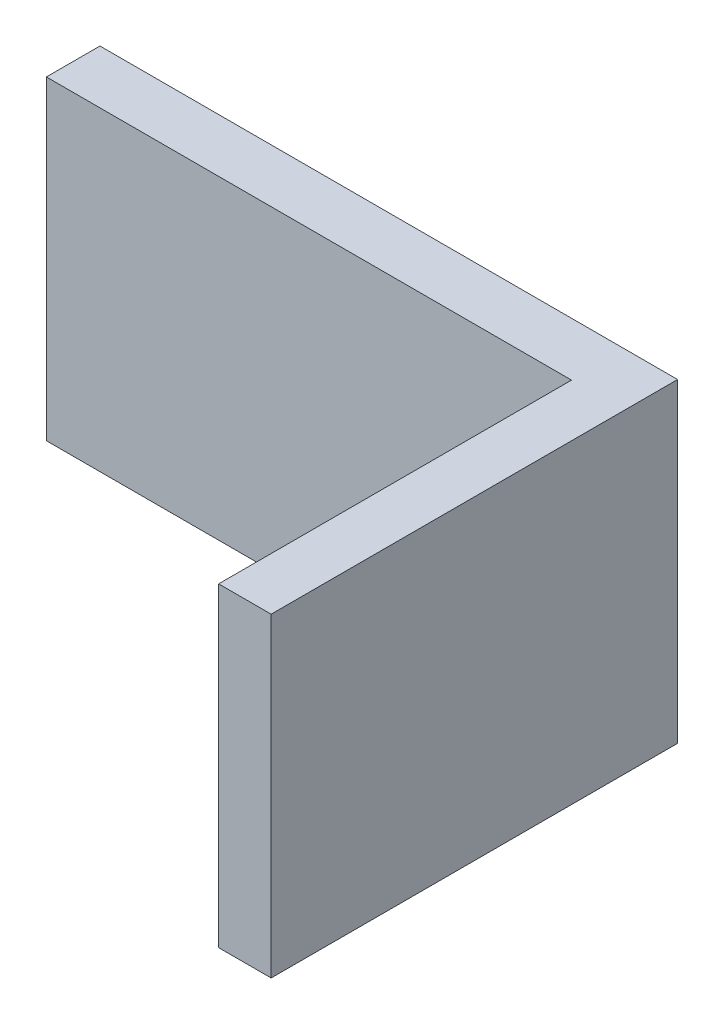
ISO-10303-21;
HEADER;
FILE_DESCRIPTION(('STEP AP214'),'2;1');
FILE_NAME('part.step','',(''),(''),'','','');
FILE_SCHEMA(('AUTOMOTIVE_DESIGN { 1 0 10303 214 1 1 1 1 }'));
ENDSEC;
DATA;
#1=APPLICATION_CONTEXT('core data for automotive mechanical design processes');
#2=APPLICATION_PROTOCOL_DEFINITION('international standard','automotive_design',2000,#1);
#3=PRODUCT_CONTEXT('',#1,'mechanical');
#4=PRODUCT('Part','Part','',(#3));
#5=PRODUCT_RELATED_PRODUCT_CATEGORY('part','',(#4));
#6=PRODUCT_DEFINITION_FORMATION('','',#4);
#7=PRODUCT_DEFINITION_CONTEXT('part definition',#1,'design');
#8=PRODUCT_DEFINITION('design','',#6,#7);
#9=PRODUCT_DEFINITION_SHAPE('','',#8);
#10=(LENGTH_UNIT() NAMED_UNIT(*) SI_UNIT(.MILLI.,.METRE.));
#11=(NAMED_UNIT(*) PLANE_ANGLE_UNIT() SI_UNIT($,.RADIAN.));
#12=(NAMED_UNIT(*) SI_UNIT($,.STERADIAN.) SOLID_ANGLE_UNIT());
#13=UNCERTAINTY_MEASURE_WITH_UNIT(LENGTH_MEASURE(1.E-05),#10,'distance_accuracy_value','');
#14=(GEOMETRIC_REPRESENTATION_CONTEXT(3) GLOBAL_UNCERTAINTY_ASSIGNED_CONTEXT((#13)) GLOBAL_UNIT_ASSIGNED_CONTEXT((#10,
#11,#12)) REPRESENTATION_CONTEXT('',''));
#15=CARTESIAN_POINT('',(0.,0.,0.));
#16=DIRECTION('',(0.,0.,1.));
#17=DIRECTION('',(1.,0.,0.));
#18=AXIS2_PLACEMENT_3D('',#15,#16,#17);
#19=CARTESIAN_POINT('',(4.55,-2.1,0.));
#20=DIRECTION('',(0.,1.,0.));
#21=DIRECTION('',(0.,0.,1.));
#22=AXIS2_PLACEMENT_3D('',#19,#20,#21);
#23=PLANE('',#22);
#24=DIRECTION('',(1.,0.,0.));
#25=VECTOR('',#24,1.);
#26=CARTESIAN_POINT('',(4.,-2.1,0.));
#27=LINE('',#26,#25);
#28=CARTESIAN_POINT('',(4.,-2.1,0.));
#29=VERTEX_POINT('',#28);
#30=CARTESIAN_POINT('',(4.55,-2.1,0.));
#31=VERTEX_POINT('',#30);
#32=EDGE_CURVE('E11',#29,#31,#27,.T.);
#33=ORIENTED_EDGE('',*,*,#32,.F.);
#34=DIRECTION('',(0.,0.,-1.));
#35=VECTOR('',#34,1.);
#36=CARTESIAN_POINT('',(4.,-2.1,0.051));
#37=LINE('',#36,#35);
#38=CARTESIAN_POINT('',(4.,-2.1,0.051));
#39=VERTEX_POINT('',#38);
#40=EDGE_CURVE('E24',#39,#29,#37,.T.);
#41=ORIENTED_EDGE('',*,*,#40,.F.);
#42=DIRECTION('',(-1.,0.,0.));
#43=VECTOR('',#42,1.);
#44=CARTESIAN_POINT('',(4.5,-2.1,0.051));
#45=LINE('',#44,#43);
#46=CARTESIAN_POINT('',(4.5,-2.1,0.051));
#47=VERTEX_POINT('',#46);
#48=EDGE_CURVE('E87',#47,#39,#45,.T.);
#49=ORIENTED_EDGE('',*,*,#48,.F.);
#50=DIRECTION('',(0.,0.,-1.));
#51=VECTOR('',#50,1.);
#52=CARTESIAN_POINT('',(4.5,-2.1,0.387));
#53=LINE('',#52,#51);
#54=CARTESIAN_POINT('',(4.5,-2.1,0.387));
#55=VERTEX_POINT('',#54);
#56=EDGE_CURVE('E114',#55,#47,#53,.T.);
#57=ORIENTED_EDGE('',*,*,#56,.F.);
#58=DIRECTION('',(-1.,0.,0.));
#59=VECTOR('',#58,1.);
#60=CARTESIAN_POINT('',(4.55,-2.1,0.387));
#61=LINE('',#60,#59);
#62=CARTESIAN_POINT('',(4.55,-2.1,0.387));
#63=VERTEX_POINT('',#62);
#64=EDGE_CURVE('E111',#63,#55,#61,.T.);
#65=ORIENTED_EDGE('',*,*,#64,.F.);
#66=DIRECTION('',(0.,0.,1.));
#67=VECTOR('',#66,1.);
#68=CARTESIAN_POINT('',(4.55,-2.1,0.));
#69=LINE('',#68,#67);
#70=EDGE_CURVE('E108',#31,#63,#69,.T.);
#71=ORIENTED_EDGE('',*,*,#70,.F.);
#72=EDGE_LOOP('',(#33,#41,#49,#57,#65,#71));
#73=FACE_BOUND('',#72,.T.);
#74=ADVANCED_FACE('F17',(#73),#23,.T.);
#75=CARTESIAN_POINT('',(4.,-2.4,0.));
#76=DIRECTION('',(0.,-1.,0.));
#77=DIRECTION('',(0.,0.,1.));
#78=AXIS2_PLACEMENT_3D('',#75,#76,#77);
#79=PLANE('',#78);
#80=DIRECTION('',(-1.,0.,0.));
#81=VECTOR('',#80,1.);
#82=CARTESIAN_POINT('',(4.55,-2.4,0.));
#83=LINE('',#82,#81);
#84=CARTESIAN_POINT('',(4.55,-2.4,0.));
#85=VERTEX_POINT('',#84);
#86=CARTESIAN_POINT('',(4.,-2.4,0.));
#87=VERTEX_POINT('',#86);
#88=EDGE_CURVE('E106',#85,#87,#83,.T.);
#89=ORIENTED_EDGE('',*,*,#88,.F.);
#90=DIRECTION('',(0.,0.,-1.));
#91=VECTOR('',#90,1.);
#92=CARTESIAN_POINT('',(4.55,-2.4,0.387));
#93=LINE('',#92,#91);
#94=CARTESIAN_POINT('',(4.55,-2.4,0.387));
#95=VERTEX_POINT('',#94);
#96=EDGE_CURVE('E103',#95,#85,#93,.T.);
#97=ORIENTED_EDGE('',*,*,#96,.F.);
#98=DIRECTION('',(1.,0.,0.));
#99=VECTOR('',#98,1.);
#100=CARTESIAN_POINT('',(4.5,-2.4,0.387));
#101=LINE('',#100,#99);
#102=CARTESIAN_POINT('',(4.5,-2.4,0.387));
#103=VERTEX_POINT('',#102);
#104=EDGE_CURVE('E100',#103,#95,#101,.T.);
#105=ORIENTED_EDGE('',*,*,#104,.F.);
#106=DIRECTION('',(0.,0.,1.));
#107=VECTOR('',#106,1.);
#108=CARTESIAN_POINT('',(4.5,-2.4,0.051));
#109=LINE('',#108,#107);
#110=CARTESIAN_POINT('',(4.5,-2.4,0.051));
#111=VERTEX_POINT('',#110);
#112=EDGE_CURVE('E72',#111,#103,#109,.T.);
#113=ORIENTED_EDGE('',*,*,#112,.F.);
#114=DIRECTION('',(1.,0.,0.));
#115=VECTOR('',#114,1.);
#116=CARTESIAN_POINT('',(4.,-2.4,0.051));
#117=LINE('',#116,#115);
#118=CARTESIAN_POINT('',(4.,-2.4,0.051));
#119=VERTEX_POINT('',#118);
#120=EDGE_CURVE('E66',#119,#111,#117,.T.);
#121=ORIENTED_EDGE('',*,*,#120,.F.);
#122=DIRECTION('',(0.,0.,1.));
#123=VECTOR('',#122,1.);
#124=CARTESIAN_POINT('',(4.,-2.4,0.));
#125=LINE('',#124,#123);
#126=EDGE_CURVE('E69',#87,#119,#125,.T.);
#127=ORIENTED_EDGE('',*,*,#126,.F.);
#128=EDGE_LOOP('',(#89,#97,#105,#113,#121,#127));
#129=FACE_BOUND('',#128,.T.);
#130=ADVANCED_FACE('F68',(#129),#79,.T.);
#131=CARTESIAN_POINT('',(4.55,-2.1,0.387));
#132=DIRECTION('',(0.,0.,1.));
#133=DIRECTION('',(0.,1.,0.));
#134=AXIS2_PLACEMENT_3D('',#131,#132,#133);
#135=PLANE('',#134);
#136=ORIENTED_EDGE('',*,*,#64,.T.);
#137=DIRECTION('',(0.,1.,0.));
#138=VECTOR('',#137,1.);
#139=CARTESIAN_POINT('',(4.5,-2.4,0.387));
#140=LINE('',#139,#138);
#141=EDGE_CURVE('E83',#103,#55,#140,.T.);
#142=ORIENTED_EDGE('',*,*,#141,.F.);
#143=ORIENTED_EDGE('',*,*,#104,.T.);
#144=DIRECTION('',(0.,-1.,0.));
#145=VECTOR('',#144,1.);
#146=CARTESIAN_POINT('',(4.55,-2.1,0.387));
#147=LINE('',#146,#145);
#148=EDGE_CURVE('E88',#63,#95,#147,.T.);
#149=ORIENTED_EDGE('',*,*,#148,.F.);
#150=EDGE_LOOP('',(#136,#142,#143,#149));
#151=FACE_BOUND('',#150,.T.);
#152=ADVANCED_FACE('F125',(#151),#135,.T.);
#153=CARTESIAN_POINT('',(4.5,-2.1,0.051));
#154=DIRECTION('',(0.,0.,1.));
#155=DIRECTION('',(0.,1.,0.));
#156=AXIS2_PLACEMENT_3D('',#153,#154,#155);
#157=PLANE('',#156);
#158=ORIENTED_EDGE('',*,*,#48,.T.);
#159=DIRECTION('',(0.,1.,0.));
#160=VECTOR('',#159,1.);
#161=CARTESIAN_POINT('',(4.,-2.4,0.051));
#162=LINE('',#161,#160);
#163=EDGE_CURVE('E81',#119,#39,#162,.T.);
#164=ORIENTED_EDGE('',*,*,#163,.F.);
#165=ORIENTED_EDGE('',*,*,#120,.T.);
#166=DIRECTION('',(0.,-1.,0.));
#167=VECTOR('',#166,1.);
#168=CARTESIAN_POINT('',(4.5,-2.1,0.051));
#169=LINE('',#168,#167);
#170=EDGE_CURVE('E89',#47,#111,#169,.T.);
#171=ORIENTED_EDGE('',*,*,#170,.F.);
#172=EDGE_LOOP('',(#158,#164,#165,#171));
#173=FACE_BOUND('',#172,.T.);
#174=ADVANCED_FACE('F86',(#173),#157,.T.);
#175=CARTESIAN_POINT('',(4.55,-2.4,0.));
#176=DIRECTION('',(1.,0.,0.));
#177=DIRECTION('',(0.,0.,1.));
#178=AXIS2_PLACEMENT_3D('',#175,#176,#177);
#179=PLANE('',#178);
#180=DIRECTION('',(0.,-1.,0.));
#181=VECTOR('',#180,1.);
#182=CARTESIAN_POINT('',(4.55,-2.1,0.));
#183=LINE('',#182,#181);
#184=EDGE_CURVE('E93',#31,#85,#183,.T.);
#185=ORIENTED_EDGE('',*,*,#184,.F.);
#186=ORIENTED_EDGE('',*,*,#70,.T.);
#187=ORIENTED_EDGE('',*,*,#148,.T.);
#188=ORIENTED_EDGE('',*,*,#96,.T.);
#189=EDGE_LOOP('',(#185,#186,#187,#188));
#190=FACE_BOUND('',#189,.T.);
#191=ADVANCED_FACE('F121',(#190),#179,.T.);
#192=CARTESIAN_POINT('',(4.,-2.1,0.));
#193=DIRECTION('',(-1.,0.,0.));
#194=DIRECTION('',(0.,0.,1.));
#195=AXIS2_PLACEMENT_3D('',#192,#193,#194);
#196=PLANE('',#195);
#197=DIRECTION('',(0.,1.,0.));
#198=VECTOR('',#197,1.);
#199=CARTESIAN_POINT('',(4.,-2.4,0.));
#200=LINE('',#199,#198);
#201=EDGE_CURVE('E82',#87,#29,#200,.T.);
#202=ORIENTED_EDGE('',*,*,#201,.F.);
#203=ORIENTED_EDGE('',*,*,#126,.T.);
#204=ORIENTED_EDGE('',*,*,#163,.T.);
#205=ORIENTED_EDGE('',*,*,#40,.T.);
#206=EDGE_LOOP('',(#202,#203,#204,#205));
#207=FACE_BOUND('',#206,.T.);
#208=ADVANCED_FACE('F80',(#207),#196,.T.);
#209=CARTESIAN_POINT('',(4.5,-2.1,0.051));
#210=DIRECTION('',(-1.,0.,0.));
#211=DIRECTION('',(0.,0.,1.));
#212=AXIS2_PLACEMENT_3D('',#209,#210,#211);
#213=PLANE('',#212);
#214=ORIENTED_EDGE('',*,*,#170,.T.);
#215=ORIENTED_EDGE('',*,*,#112,.T.);
#216=ORIENTED_EDGE('',*,*,#141,.T.);
#217=ORIENTED_EDGE('',*,*,#56,.T.);
#218=EDGE_LOOP('',(#214,#215,#216,#217));
#219=FACE_BOUND('',#218,.T.);
#220=ADVANCED_FACE('F127',(#219),#213,.T.);
#221=CARTESIAN_POINT('',(4.55,-2.4,0.));
#222=DIRECTION('',(0.,0.,-1.));
#223=DIRECTION('',(0.,1.,0.));
#224=AXIS2_PLACEMENT_3D('',#221,#222,#223);
#225=PLANE('',#224);
#226=ORIENTED_EDGE('',*,*,#88,.T.);
#227=ORIENTED_EDGE('',*,*,#201,.T.);
#228=ORIENTED_EDGE('',*,*,#32,.T.);
#229=ORIENTED_EDGE('',*,*,#184,.T.);
#230=EDGE_LOOP('',(#226,#227,#228,#229));
#231=FACE_BOUND('',#230,.T.);
#232=ADVANCED_FACE('F117',(#231),#225,.T.);
#233=CLOSED_SHELL('',(#74,#130,#152,#174,#191,#208,#220,#232));
#234=MANIFOLD_SOLID_BREP('B1',#233);
#235=ADVANCED_BREP_SHAPE_REPRESENTATION('',(#18,#234),#14);
#236=SHAPE_DEFINITION_REPRESENTATION(#9,#235);
ENDSEC;
END-ISO-10303-21;
